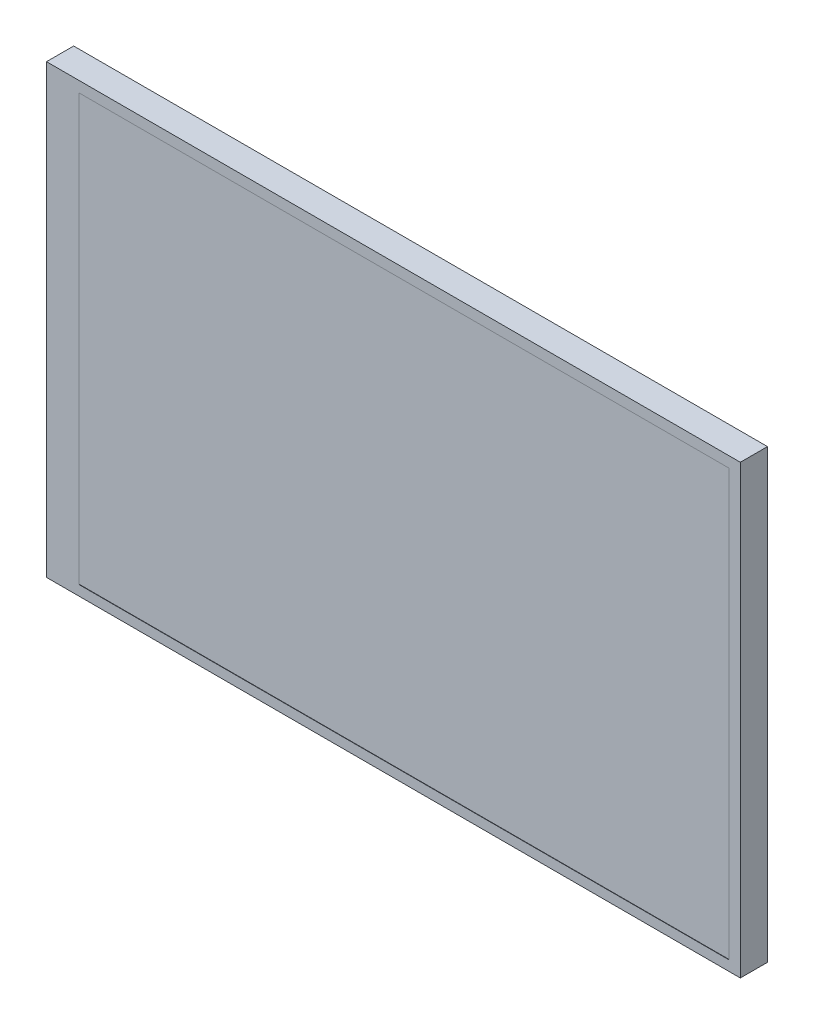
ISO-10303-21;
HEADER;
FILE_DESCRIPTION(('STEP AP214'),'2;1');
FILE_NAME('part.step','',(''),(''),'','','');
FILE_SCHEMA(('AUTOMOTIVE_DESIGN { 1 0 10303 214 1 1 1 1 }'));
ENDSEC;
DATA;
#1=APPLICATION_CONTEXT('core data for automotive mechanical design processes');
#2=APPLICATION_PROTOCOL_DEFINITION('international standard','automotive_design',2000,#1);
#3=PRODUCT_CONTEXT('',#1,'mechanical');
#4=PRODUCT('Part','Part','',(#3));
#5=PRODUCT_RELATED_PRODUCT_CATEGORY('part','',(#4));
#6=PRODUCT_DEFINITION_FORMATION('','',#4);
#7=PRODUCT_DEFINITION_CONTEXT('part definition',#1,'design');
#8=PRODUCT_DEFINITION('design','',#6,#7);
#9=PRODUCT_DEFINITION_SHAPE('','',#8);
#10=(LENGTH_UNIT() NAMED_UNIT(*) SI_UNIT(.MILLI.,.METRE.));
#11=(NAMED_UNIT(*) PLANE_ANGLE_UNIT() SI_UNIT($,.RADIAN.));
#12=(NAMED_UNIT(*) SI_UNIT($,.STERADIAN.) SOLID_ANGLE_UNIT());
#13=UNCERTAINTY_MEASURE_WITH_UNIT(LENGTH_MEASURE(1.E-05),#10,'distance_accuracy_value','');
#14=(GEOMETRIC_REPRESENTATION_CONTEXT(3) GLOBAL_UNCERTAINTY_ASSIGNED_CONTEXT((#13)) GLOBAL_UNIT_ASSIGNED_CONTEXT((#10,
#11,#12)) REPRESENTATION_CONTEXT('',''));
#15=CARTESIAN_POINT('',(0.,0.,0.));
#16=DIRECTION('',(0.,0.,1.));
#17=DIRECTION('',(1.,0.,0.));
#18=AXIS2_PLACEMENT_3D('',#15,#16,#17);
#19=CARTESIAN_POINT('',(0.,0.,3.7));
#20=DIRECTION('',(1.,0.,0.));
#21=DIRECTION('',(0.,1.,0.));
#22=AXIS2_PLACEMENT_3D('',#19,#20,#21);
#23=PLANE('',#22);
#24=DIRECTION('',(0.,-1.,0.));
#25=VECTOR('',#24,1.);
#26=CARTESIAN_POINT('',(0.,0.,0.));
#27=LINE('',#26,#25);
#28=CARTESIAN_POINT('',(0.,60.88,0.));
#29=VERTEX_POINT('',#28);
#30=CARTESIAN_POINT('',(0.,51.4389339288591,0.));
#31=VERTEX_POINT('',#30);
#32=EDGE_CURVE('E360',#29,#31,#27,.T.);
#33=ORIENTED_EDGE('',*,*,#32,.T.);
#34=DIRECTION('',(0.,0.,1.));
#35=VECTOR('',#34,1.);
#36=CARTESIAN_POINT('',(0.,51.4389339288591,-0.05));
#37=LINE('',#36,#35);
#38=CARTESIAN_POINT('',(0.,51.4389339288591,-0.05));
#39=VERTEX_POINT('',#38);
#40=EDGE_CURVE('E47',#39,#31,#37,.T.);
#41=ORIENTED_EDGE('',*,*,#40,.F.);
#42=DIRECTION('',(0.,1.,0.));
#43=VECTOR('',#42,1.);
#44=CARTESIAN_POINT('',(0.,0.,-0.05));
#45=LINE('',#44,#43);
#46=CARTESIAN_POINT('',(0.,9.44106607114088,-0.05));
#47=VERTEX_POINT('',#46);
#48=EDGE_CURVE('E227',#47,#39,#45,.T.);
#49=ORIENTED_EDGE('',*,*,#48,.F.);
#50=DIRECTION('',(0.,0.,1.));
#51=VECTOR('',#50,1.);
#52=CARTESIAN_POINT('',(0.,9.44106607114088,-0.05));
#53=LINE('',#52,#51);
#54=CARTESIAN_POINT('',(0.,9.44106607114088,0.));
#55=VERTEX_POINT('',#54);
#56=EDGE_CURVE('E266',#47,#55,#53,.T.);
#57=ORIENTED_EDGE('',*,*,#56,.T.);
#58=CARTESIAN_POINT('',(0.,0.,0.));
#59=VERTEX_POINT('',#58);
#60=EDGE_CURVE('E343',#55,#59,#27,.T.);
#61=ORIENTED_EDGE('',*,*,#60,.T.);
#62=DIRECTION('',(0.,0.,-1.));
#63=VECTOR('',#62,1.);
#64=CARTESIAN_POINT('',(0.,0.,3.7));
#65=LINE('',#64,#63);
#66=CARTESIAN_POINT('',(0.,0.,3.7));
#67=VERTEX_POINT('',#66);
#68=EDGE_CURVE('E11',#67,#59,#65,.T.);
#69=ORIENTED_EDGE('',*,*,#68,.F.);
#70=DIRECTION('',(0.,-1.,0.));
#71=VECTOR('',#70,1.);
#72=CARTESIAN_POINT('',(0.,0.,3.7));
#73=LINE('',#72,#71);
#74=CARTESIAN_POINT('',(0.,60.88,3.7));
#75=VERTEX_POINT('',#74);
#76=EDGE_CURVE('E349',#75,#67,#73,.T.);
#77=ORIENTED_EDGE('',*,*,#76,.F.);
#78=DIRECTION('',(0.,0.,-1.));
#79=VECTOR('',#78,1.);
#80=CARTESIAN_POINT('',(0.,60.88,3.7));
#81=LINE('',#80,#79);
#82=EDGE_CURVE('E359',#75,#29,#81,.T.);
#83=ORIENTED_EDGE('',*,*,#82,.T.);
#84=EDGE_LOOP('',(#33,#41,#49,#57,#61,#69,#77,#83));
#85=FACE_BOUND('',#84,.T.);
#86=ADVANCED_FACE('F33',(#85),#23,.F.);
#87=CARTESIAN_POINT('',(0.,0.,3.7));
#88=DIRECTION('',(0.,1.,0.));
#89=DIRECTION('',(0.,0.,1.));
#90=AXIS2_PLACEMENT_3D('',#87,#88,#89);
#91=PLANE('',#90);
#92=DIRECTION('',(1.,0.,0.));
#93=VECTOR('',#92,1.);
#94=CARTESIAN_POINT('',(0.,0.,0.));
#95=LINE('',#94,#93);
#96=CARTESIAN_POINT('',(94.57,0.,0.));
#97=VERTEX_POINT('',#96);
#98=EDGE_CURVE('E363',#59,#97,#95,.T.);
#99=ORIENTED_EDGE('',*,*,#98,.T.);
#100=DIRECTION('',(0.,0.,-1.));
#101=VECTOR('',#100,1.);
#102=CARTESIAN_POINT('',(94.57,0.,3.7));
#103=LINE('',#102,#101);
#104=CARTESIAN_POINT('',(94.57,0.,3.7));
#105=VERTEX_POINT('',#104);
#106=EDGE_CURVE('E40',#105,#97,#103,.T.);
#107=ORIENTED_EDGE('',*,*,#106,.F.);
#108=DIRECTION('',(1.,0.,0.));
#109=VECTOR('',#108,1.);
#110=CARTESIAN_POINT('',(0.,0.,3.7));
#111=LINE('',#110,#109);
#112=EDGE_CURVE('E352',#67,#105,#111,.T.);
#113=ORIENTED_EDGE('',*,*,#112,.F.);
#114=ORIENTED_EDGE('',*,*,#68,.T.);
#115=EDGE_LOOP('',(#99,#107,#113,#114));
#116=FACE_BOUND('',#115,.T.);
#117=ADVANCED_FACE('F396',(#116),#91,.F.);
#118=CARTESIAN_POINT('',(94.57,0.,3.7));
#119=DIRECTION('',(-1.,0.,0.));
#120=DIRECTION('',(0.,-1.,0.));
#121=AXIS2_PLACEMENT_3D('',#118,#119,#120);
#122=PLANE('',#121);
#123=DIRECTION('',(0.,1.,0.));
#124=VECTOR('',#123,1.);
#125=CARTESIAN_POINT('',(94.57,0.,0.));
#126=LINE('',#125,#124);
#127=CARTESIAN_POINT('',(94.57,60.88,0.));
#128=VERTEX_POINT('',#127);
#129=EDGE_CURVE('E365',#97,#128,#126,.T.);
#130=ORIENTED_EDGE('',*,*,#129,.T.);
#131=DIRECTION('',(0.,0.,-1.));
#132=VECTOR('',#131,1.);
#133=CARTESIAN_POINT('',(94.57,60.88,3.7));
#134=LINE('',#133,#132);
#135=CARTESIAN_POINT('',(94.57,60.88,3.7));
#136=VERTEX_POINT('',#135);
#137=EDGE_CURVE('E370',#136,#128,#134,.T.);
#138=ORIENTED_EDGE('',*,*,#137,.F.);
#139=DIRECTION('',(0.,1.,0.));
#140=VECTOR('',#139,1.);
#141=CARTESIAN_POINT('',(94.57,0.,3.7));
#142=LINE('',#141,#140);
#143=EDGE_CURVE('E355',#105,#136,#142,.T.);
#144=ORIENTED_EDGE('',*,*,#143,.F.);
#145=ORIENTED_EDGE('',*,*,#106,.T.);
#146=EDGE_LOOP('',(#130,#138,#144,#145));
#147=FACE_BOUND('',#146,.T.);
#148=ADVANCED_FACE('F377',(#147),#122,.F.);
#149=CARTESIAN_POINT('',(0.,60.88,3.7));
#150=DIRECTION('',(0.,-1.,0.));
#151=DIRECTION('',(0.,0.,-1.));
#152=AXIS2_PLACEMENT_3D('',#149,#150,#151);
#153=PLANE('',#152);
#154=DIRECTION('',(-1.,0.,0.));
#155=VECTOR('',#154,1.);
#156=CARTESIAN_POINT('',(0.,60.88,0.));
#157=LINE('',#156,#155);
#158=EDGE_CURVE('E353',#128,#29,#157,.T.);
#159=ORIENTED_EDGE('',*,*,#158,.T.);
#160=ORIENTED_EDGE('',*,*,#82,.F.);
#161=DIRECTION('',(-1.,0.,0.));
#162=VECTOR('',#161,1.);
#163=CARTESIAN_POINT('',(0.,60.88,3.7));
#164=LINE('',#163,#162);
#165=EDGE_CURVE('E357',#136,#75,#164,.T.);
#166=ORIENTED_EDGE('',*,*,#165,.F.);
#167=ORIENTED_EDGE('',*,*,#137,.T.);
#168=EDGE_LOOP('',(#159,#160,#166,#167));
#169=FACE_BOUND('',#168,.T.);
#170=ADVANCED_FACE('F389',(#169),#153,.F.);
#171=CARTESIAN_POINT('',(0.,0.,3.7));
#172=DIRECTION('',(0.,0.,-1.));
#173=DIRECTION('',(-1.,0.,0.));
#174=AXIS2_PLACEMENT_3D('',#171,#172,#173);
#175=PLANE('',#174);
#176=DIRECTION('',(-1.,0.,0.));
#177=VECTOR('',#176,1.);
#178=CARTESIAN_POINT('',(93.024602875844,59.4131648538576,3.7));
#179=LINE('',#178,#177);
#180=CARTESIAN_POINT('',(93.024602875844,59.4131648538576,3.7));
#181=VERTEX_POINT('',#180);
#182=CARTESIAN_POINT('',(4.39521661797805,59.4131648538576,3.7));
#183=VERTEX_POINT('',#182);
#184=EDGE_CURVE('E333',#181,#183,#179,.T.);
#185=ORIENTED_EDGE('',*,*,#184,.F.);
#186=DIRECTION('',(0.,1.,0.));
#187=VECTOR('',#186,1.);
#188=CARTESIAN_POINT('',(93.024602875844,59.4131648538576,3.7));
#189=LINE('',#188,#187);
#190=CARTESIAN_POINT('',(93.024602875844,1.37184116301504,3.7));
#191=VERTEX_POINT('',#190);
#192=EDGE_CURVE('E55',#191,#181,#189,.T.);
#193=ORIENTED_EDGE('',*,*,#192,.F.);
#194=DIRECTION('',(1.,0.,0.));
#195=VECTOR('',#194,1.);
#196=CARTESIAN_POINT('',(93.024602875844,1.37184116301504,3.7));
#197=LINE('',#196,#195);
#198=CARTESIAN_POINT('',(4.39521661797805,1.37184116301504,3.7));
#199=VERTEX_POINT('',#198);
#200=EDGE_CURVE('E322',#199,#191,#197,.T.);
#201=ORIENTED_EDGE('',*,*,#200,.F.);
#202=DIRECTION('',(0.,-1.,0.));
#203=VECTOR('',#202,1.);
#204=CARTESIAN_POINT('',(4.39521661797805,59.4131648538576,3.7));
#205=LINE('',#204,#203);
#206=EDGE_CURVE('E336',#183,#199,#205,.T.);
#207=ORIENTED_EDGE('',*,*,#206,.F.);
#208=EDGE_LOOP('',(#185,#193,#201,#207));
#209=FACE_BOUND('',#208,.T.);
#210=ORIENTED_EDGE('',*,*,#76,.T.);
#211=ORIENTED_EDGE('',*,*,#112,.T.);
#212=ORIENTED_EDGE('',*,*,#143,.T.);
#213=ORIENTED_EDGE('',*,*,#165,.T.);
#214=EDGE_LOOP('',(#210,#211,#212,#213));
#215=FACE_BOUND('',#214,.T.);
#216=ADVANCED_FACE('F395',(#209,#215),#175,.F.);
#217=CARTESIAN_POINT('',(0.,0.,0.));
#218=DIRECTION('',(0.,0.,-1.));
#219=DIRECTION('',(-1.,0.,0.));
#220=AXIS2_PLACEMENT_3D('',#217,#218,#219);
#221=PLANE('',#220);
#222=DIRECTION('',(-1.,0.,0.));
#223=VECTOR('',#222,1.);
#224=CARTESIAN_POINT('',(0.,9.44106607114088,0.));
#225=LINE('',#224,#223);
#226=CARTESIAN_POINT('',(9.09958970191095,9.44106607114088,0.));
#227=VERTEX_POINT('',#226);
#228=EDGE_CURVE('E230',#227,#55,#225,.T.);
#229=ORIENTED_EDGE('',*,*,#228,.F.);
#230=CARTESIAN_POINT('',(9.09958970191096,11.4410660711409,0.));
#231=DIRECTION('',(0.,0.,-1.));
#232=DIRECTION('',(-1.,0.,0.));
#233=AXIS2_PLACEMENT_3D('',#230,#231,#232);
#234=CIRCLE('',#233,2.);
#235=CARTESIAN_POINT('',(11.099589701911,11.4410660711409,0.));
#236=VERTEX_POINT('',#235);
#237=EDGE_CURVE('E289',#227,#236,#234,.F.);
#238=ORIENTED_EDGE('',*,*,#237,.T.);
#239=DIRECTION('',(0.,1.,0.));
#240=VECTOR('',#239,1.);
#241=CARTESIAN_POINT('',(11.099589701911,0.,0.));
#242=LINE('',#241,#240);
#243=CARTESIAN_POINT('',(11.099589701911,17.94,0.));
#244=VERTEX_POINT('',#243);
#245=EDGE_CURVE('E286',#236,#244,#242,.T.);
#246=ORIENTED_EDGE('',*,*,#245,.T.);
#247=CARTESIAN_POINT('',(13.099589701911,17.94,0.));
#248=DIRECTION('',(0.,0.,-1.));
#249=DIRECTION('',(-1.,0.,0.));
#250=AXIS2_PLACEMENT_3D('',#247,#248,#249);
#251=CIRCLE('',#250,2.);
#252=CARTESIAN_POINT('',(13.099589701911,19.94,0.));
#253=VERTEX_POINT('',#252);
#254=EDGE_CURVE('E283',#244,#253,#251,.T.);
#255=ORIENTED_EDGE('',*,*,#254,.T.);
#256=DIRECTION('',(1.,0.,0.));
#257=VECTOR('',#256,1.);
#258=CARTESIAN_POINT('',(0.,19.94,0.));
#259=LINE('',#258,#257);
#260=CARTESIAN_POINT('',(40.,19.94,0.));
#261=VERTEX_POINT('',#260);
#262=EDGE_CURVE('E280',#253,#261,#259,.T.);
#263=ORIENTED_EDGE('',*,*,#262,.T.);
#264=DIRECTION('',(0.,-1.,0.));
#265=VECTOR('',#264,1.);
#266=CARTESIAN_POINT('',(40.,0.,0.));
#267=LINE('',#266,#265);
#268=CARTESIAN_POINT('',(40.,40.94,0.));
#269=VERTEX_POINT('',#268);
#270=EDGE_CURVE('E277',#269,#261,#267,.T.);
#271=ORIENTED_EDGE('',*,*,#270,.F.);
#272=DIRECTION('',(1.,0.,0.));
#273=VECTOR('',#272,1.);
#274=CARTESIAN_POINT('',(0.,40.94,0.));
#275=LINE('',#274,#273);
#276=CARTESIAN_POINT('',(13.099589701911,40.94,0.));
#277=VERTEX_POINT('',#276);
#278=EDGE_CURVE('E275',#277,#269,#275,.T.);
#279=ORIENTED_EDGE('',*,*,#278,.F.);
#280=CARTESIAN_POINT('',(13.099589701911,42.94,0.));
#281=DIRECTION('',(0.,0.,-1.));
#282=DIRECTION('',(-1.,0.,0.));
#283=AXIS2_PLACEMENT_3D('',#280,#281,#282);
#284=CIRCLE('',#283,2.);
#285=CARTESIAN_POINT('',(11.099589701911,42.94,0.));
#286=VERTEX_POINT('',#285);
#287=EDGE_CURVE('E273',#286,#277,#284,.F.);
#288=ORIENTED_EDGE('',*,*,#287,.F.);
#289=DIRECTION('',(0.,1.,0.));
#290=VECTOR('',#289,1.);
#291=CARTESIAN_POINT('',(11.099589701911,0.,0.));
#292=LINE('',#291,#290);
#293=CARTESIAN_POINT('',(11.099589701911,49.4389339288591,0.));
#294=VERTEX_POINT('',#293);
#295=EDGE_CURVE('E270',#286,#294,#292,.T.);
#296=ORIENTED_EDGE('',*,*,#295,.T.);
#297=CARTESIAN_POINT('',(9.09958970191097,49.4389339288591,0.));
#298=DIRECTION('',(0.,0.,-1.));
#299=DIRECTION('',(-1.,0.,0.));
#300=AXIS2_PLACEMENT_3D('',#297,#298,#299);
#301=CIRCLE('',#300,2.);
#302=CARTESIAN_POINT('',(9.09958970191095,51.4389339288591,0.));
#303=VERTEX_POINT('',#302);
#304=EDGE_CURVE('E221',#294,#303,#301,.F.);
#305=ORIENTED_EDGE('',*,*,#304,.T.);
#306=DIRECTION('',(-1.,0.,0.));
#307=VECTOR('',#306,1.);
#308=CARTESIAN_POINT('',(0.,51.4389339288591,0.));
#309=LINE('',#308,#307);
#310=EDGE_CURVE('E219',#303,#31,#309,.T.);
#311=ORIENTED_EDGE('',*,*,#310,.T.);
#312=ORIENTED_EDGE('',*,*,#32,.F.);
#313=ORIENTED_EDGE('',*,*,#158,.F.);
#314=ORIENTED_EDGE('',*,*,#129,.F.);
#315=ORIENTED_EDGE('',*,*,#98,.F.);
#316=ORIENTED_EDGE('',*,*,#60,.F.);
#317=EDGE_LOOP('',(#229,#238,#246,#255,#263,#271,#279,#288,#296,#305,#311,#312,#313,#314,#315,#316));
#318=FACE_BOUND('',#317,.T.);
#319=ADVANCED_FACE('F384',(#318),#221,.T.);
#320=CARTESIAN_POINT('',(93.024602875844,59.4131648538576,3.65));
#321=DIRECTION('',(1.,0.,0.));
#322=DIRECTION('',(0.,0.,-1.));
#323=AXIS2_PLACEMENT_3D('',#320,#321,#322);
#324=PLANE('',#323);
#325=ORIENTED_EDGE('',*,*,#192,.T.);
#326=DIRECTION('',(0.,0.,1.));
#327=VECTOR('',#326,1.);
#328=CARTESIAN_POINT('',(93.024602875844,59.4131648538576,3.65));
#329=LINE('',#328,#327);
#330=CARTESIAN_POINT('',(93.024602875844,59.4131648538576,3.65));
#331=VERTEX_POINT('',#330);
#332=EDGE_CURVE('E331',#331,#181,#329,.T.);
#333=ORIENTED_EDGE('',*,*,#332,.F.);
#334=DIRECTION('',(0.,1.,0.));
#335=VECTOR('',#334,1.);
#336=CARTESIAN_POINT('',(93.024602875844,59.4131648538576,3.65));
#337=LINE('',#336,#335);
#338=CARTESIAN_POINT('',(93.024602875844,1.37184116301504,3.65));
#339=VERTEX_POINT('',#338);
#340=EDGE_CURVE('E318',#339,#331,#337,.T.);
#341=ORIENTED_EDGE('',*,*,#340,.F.);
#342=DIRECTION('',(0.,0.,1.));
#343=VECTOR('',#342,1.);
#344=CARTESIAN_POINT('',(93.024602875844,1.37184116301504,3.65));
#345=LINE('',#344,#343);
#346=EDGE_CURVE('E341',#339,#191,#345,.T.);
#347=ORIENTED_EDGE('',*,*,#346,.T.);
#348=EDGE_LOOP('',(#325,#333,#341,#347));
#349=FACE_BOUND('',#348,.T.);
#350=ADVANCED_FACE('F408',(#349),#324,.F.);
#351=CARTESIAN_POINT('',(93.024602875844,1.37184116301504,3.65));
#352=DIRECTION('',(0.,-1.,0.));
#353=DIRECTION('',(0.,0.,-1.));
#354=AXIS2_PLACEMENT_3D('',#351,#352,#353);
#355=PLANE('',#354);
#356=ORIENTED_EDGE('',*,*,#200,.T.);
#357=ORIENTED_EDGE('',*,*,#346,.F.);
#358=DIRECTION('',(1.,0.,0.));
#359=VECTOR('',#358,1.);
#360=CARTESIAN_POINT('',(93.024602875844,1.37184116301504,3.65));
#361=LINE('',#360,#359);
#362=CARTESIAN_POINT('',(4.39521661797805,1.37184116301504,3.65));
#363=VERTEX_POINT('',#362);
#364=EDGE_CURVE('E328',#363,#339,#361,.T.);
#365=ORIENTED_EDGE('',*,*,#364,.F.);
#366=DIRECTION('',(0.,0.,1.));
#367=VECTOR('',#366,1.);
#368=CARTESIAN_POINT('',(4.39521661797805,1.37184116301504,3.65));
#369=LINE('',#368,#367);
#370=EDGE_CURVE('E344',#363,#199,#369,.T.);
#371=ORIENTED_EDGE('',*,*,#370,.T.);
#372=EDGE_LOOP('',(#356,#357,#365,#371));
#373=FACE_BOUND('',#372,.T.);
#374=ADVANCED_FACE('F414',(#373),#355,.F.);
#375=CARTESIAN_POINT('',(4.39521661797805,59.4131648538576,3.65));
#376=DIRECTION('',(-1.,0.,0.));
#377=DIRECTION('',(0.,0.,1.));
#378=AXIS2_PLACEMENT_3D('',#375,#376,#377);
#379=PLANE('',#378);
#380=ORIENTED_EDGE('',*,*,#206,.T.);
#381=ORIENTED_EDGE('',*,*,#370,.F.);
#382=DIRECTION('',(0.,-1.,0.));
#383=VECTOR('',#382,1.);
#384=CARTESIAN_POINT('',(4.39521661797805,59.4131648538576,3.65));
#385=LINE('',#384,#383);
#386=CARTESIAN_POINT('',(4.39521661797805,59.4131648538576,3.65));
#387=VERTEX_POINT('',#386);
#388=EDGE_CURVE('E325',#387,#363,#385,.T.);
#389=ORIENTED_EDGE('',*,*,#388,.F.);
#390=DIRECTION('',(0.,0.,1.));
#391=VECTOR('',#390,1.);
#392=CARTESIAN_POINT('',(4.39521661797805,59.4131648538576,3.65));
#393=LINE('',#392,#391);
#394=EDGE_CURVE('E346',#387,#183,#393,.T.);
#395=ORIENTED_EDGE('',*,*,#394,.T.);
#396=EDGE_LOOP('',(#380,#381,#389,#395));
#397=FACE_BOUND('',#396,.T.);
#398=ADVANCED_FACE('F419',(#397),#379,.F.);
#399=CARTESIAN_POINT('',(93.024602875844,59.4131648538576,3.65));
#400=DIRECTION('',(0.,1.,0.));
#401=DIRECTION('',(0.,0.,1.));
#402=AXIS2_PLACEMENT_3D('',#399,#400,#401);
#403=PLANE('',#402);
#404=ORIENTED_EDGE('',*,*,#184,.T.);
#405=ORIENTED_EDGE('',*,*,#394,.F.);
#406=DIRECTION('',(-1.,0.,0.));
#407=VECTOR('',#406,1.);
#408=CARTESIAN_POINT('',(93.024602875844,59.4131648538576,3.65));
#409=LINE('',#408,#407);
#410=EDGE_CURVE('E321',#331,#387,#409,.T.);
#411=ORIENTED_EDGE('',*,*,#410,.F.);
#412=ORIENTED_EDGE('',*,*,#332,.T.);
#413=EDGE_LOOP('',(#404,#405,#411,#412));
#414=FACE_BOUND('',#413,.T.);
#415=ADVANCED_FACE('F415',(#414),#403,.F.);
#416=CARTESIAN_POINT('',(0.,0.,3.65));
#417=DIRECTION('',(0.,0.,-1.));
#418=DIRECTION('',(-1.,0.,0.));
#419=AXIS2_PLACEMENT_3D('',#416,#417,#418);
#420=PLANE('',#419);
#421=ORIENTED_EDGE('',*,*,#340,.T.);
#422=ORIENTED_EDGE('',*,*,#410,.T.);
#423=ORIENTED_EDGE('',*,*,#388,.T.);
#424=ORIENTED_EDGE('',*,*,#364,.T.);
#425=EDGE_LOOP('',(#421,#422,#423,#424));
#426=FACE_BOUND('',#425,.T.);
#427=ADVANCED_FACE('F418',(#426),#420,.F.);
#428=CARTESIAN_POINT('',(0.,51.4389339288591,-0.05));
#429=DIRECTION('',(0.,1.,0.));
#430=DIRECTION('',(0.,0.,1.));
#431=AXIS2_PLACEMENT_3D('',#428,#429,#430);
#432=PLANE('',#431);
#433=ORIENTED_EDGE('',*,*,#310,.F.);
#434=DIRECTION('',(0.,0.,1.));
#435=VECTOR('',#434,1.);
#436=CARTESIAN_POINT('',(9.09958970191095,51.4389339288591,-0.05));
#437=LINE('',#436,#435);
#438=CARTESIAN_POINT('',(9.09958970191095,51.4389339288591,-0.05));
#439=VERTEX_POINT('',#438);
#440=EDGE_CURVE('E315',#439,#303,#437,.T.);
#441=ORIENTED_EDGE('',*,*,#440,.F.);
#442=DIRECTION('',(-1.,0.,0.));
#443=VECTOR('',#442,1.);
#444=CARTESIAN_POINT('',(0.,51.4389339288591,-0.05));
#445=LINE('',#444,#443);
#446=EDGE_CURVE('E229',#439,#39,#445,.T.);
#447=ORIENTED_EDGE('',*,*,#446,.T.);
#448=ORIENTED_EDGE('',*,*,#40,.T.);
#449=EDGE_LOOP('',(#433,#441,#447,#448));
#450=FACE_BOUND('',#449,.T.);
#451=ADVANCED_FACE('F429',(#450),#432,.T.);
#452=CARTESIAN_POINT('',(9.09958970191097,49.4389339288591,-0.05));
#453=DIRECTION('',(0.,0.,1.));
#454=DIRECTION('',(1.,0.,0.));
#455=AXIS2_PLACEMENT_3D('',#452,#453,#454);
#456=CYLINDRICAL_SURFACE('',#455,2.);
#457=ORIENTED_EDGE('',*,*,#304,.F.);
#458=DIRECTION('',(0.,0.,1.));
#459=VECTOR('',#458,1.);
#460=CARTESIAN_POINT('',(11.099589701911,49.4389339288591,-0.05));
#461=LINE('',#460,#459);
#462=CARTESIAN_POINT('',(11.099589701911,49.4389339288591,-0.05));
#463=VERTEX_POINT('',#462);
#464=EDGE_CURVE('E313',#463,#294,#461,.T.);
#465=ORIENTED_EDGE('',*,*,#464,.F.);
#466=CARTESIAN_POINT('',(9.09958970191097,49.4389339288591,-0.05));
#467=DIRECTION('',(0.,0.,-1.));
#468=DIRECTION('',(-1.,0.,0.));
#469=AXIS2_PLACEMENT_3D('',#466,#467,#468);
#470=CIRCLE('',#469,2.);
#471=EDGE_CURVE('E232',#463,#439,#470,.F.);
#472=ORIENTED_EDGE('',*,*,#471,.T.);
#473=ORIENTED_EDGE('',*,*,#440,.T.);
#474=EDGE_LOOP('',(#457,#465,#472,#473));
#475=FACE_BOUND('',#474,.T.);
#476=ADVANCED_FACE('F433',(#475),#456,.T.);
#477=CARTESIAN_POINT('',(11.099589701911,0.,-0.05));
#478=DIRECTION('',(1.,0.,0.));
#479=DIRECTION('',(0.,0.,-1.));
#480=AXIS2_PLACEMENT_3D('',#477,#478,#479);
#481=PLANE('',#480);
#482=ORIENTED_EDGE('',*,*,#295,.F.);
#483=DIRECTION('',(0.,0.,1.));
#484=VECTOR('',#483,1.);
#485=CARTESIAN_POINT('',(11.099589701911,42.94,-0.05));
#486=LINE('',#485,#484);
#487=CARTESIAN_POINT('',(11.099589701911,42.94,-0.05));
#488=VERTEX_POINT('',#487);
#489=EDGE_CURVE('E311',#488,#286,#486,.T.);
#490=ORIENTED_EDGE('',*,*,#489,.F.);
#491=DIRECTION('',(0.,1.,0.));
#492=VECTOR('',#491,1.);
#493=CARTESIAN_POINT('',(11.099589701911,0.,-0.05));
#494=LINE('',#493,#492);
#495=EDGE_CURVE('E235',#488,#463,#494,.T.);
#496=ORIENTED_EDGE('',*,*,#495,.T.);
#497=ORIENTED_EDGE('',*,*,#464,.T.);
#498=EDGE_LOOP('',(#482,#490,#496,#497));
#499=FACE_BOUND('',#498,.T.);
#500=ADVANCED_FACE('F436',(#499),#481,.T.);
#501=CARTESIAN_POINT('',(13.099589701911,42.94,-0.05));
#502=DIRECTION('',(0.,0.,1.));
#503=DIRECTION('',(1.,0.,0.));
#504=AXIS2_PLACEMENT_3D('',#501,#502,#503);
#505=CYLINDRICAL_SURFACE('',#504,2.);
#506=ORIENTED_EDGE('',*,*,#287,.T.);
#507=DIRECTION('',(0.,0.,1.));
#508=VECTOR('',#507,1.);
#509=CARTESIAN_POINT('',(13.099589701911,40.94,-0.05));
#510=LINE('',#509,#508);
#511=CARTESIAN_POINT('',(13.099589701911,40.94,-0.05));
#512=VERTEX_POINT('',#511);
#513=EDGE_CURVE('E308',#512,#277,#510,.T.);
#514=ORIENTED_EDGE('',*,*,#513,.F.);
#515=CARTESIAN_POINT('',(13.099589701911,42.94,-0.05));
#516=DIRECTION('',(0.,0.,-1.));
#517=DIRECTION('',(-1.,0.,0.));
#518=AXIS2_PLACEMENT_3D('',#515,#516,#517);
#519=CIRCLE('',#518,2.);
#520=EDGE_CURVE('E238',#488,#512,#519,.F.);
#521=ORIENTED_EDGE('',*,*,#520,.F.);
#522=ORIENTED_EDGE('',*,*,#489,.T.);
#523=EDGE_LOOP('',(#506,#514,#521,#522));
#524=FACE_BOUND('',#523,.T.);
#525=ADVANCED_FACE('F440',(#524),#505,.F.);
#526=CARTESIAN_POINT('',(0.,40.94,-0.05));
#527=DIRECTION('',(0.,-1.,0.));
#528=DIRECTION('',(0.,0.,-1.));
#529=AXIS2_PLACEMENT_3D('',#526,#527,#528);
#530=PLANE('',#529);
#531=ORIENTED_EDGE('',*,*,#278,.T.);
#532=DIRECTION('',(0.,0.,1.));
#533=VECTOR('',#532,1.);
#534=CARTESIAN_POINT('',(40.,40.94,-0.05));
#535=LINE('',#534,#533);
#536=CARTESIAN_POINT('',(40.,40.94,-0.05));
#537=VERTEX_POINT('',#536);
#538=EDGE_CURVE('E305',#537,#269,#535,.T.);
#539=ORIENTED_EDGE('',*,*,#538,.F.);
#540=DIRECTION('',(1.,0.,0.));
#541=VECTOR('',#540,1.);
#542=CARTESIAN_POINT('',(0.,40.94,-0.05));
#543=LINE('',#542,#541);
#544=EDGE_CURVE('E240',#512,#537,#543,.T.);
#545=ORIENTED_EDGE('',*,*,#544,.F.);
#546=ORIENTED_EDGE('',*,*,#513,.T.);
#547=EDGE_LOOP('',(#531,#539,#545,#546));
#548=FACE_BOUND('',#547,.T.);
#549=ADVANCED_FACE('F444',(#548),#530,.F.);
#550=CARTESIAN_POINT('',(40.,0.,-0.05));
#551=DIRECTION('',(-1.,0.,0.));
#552=DIRECTION('',(0.,-1.,0.));
#553=AXIS2_PLACEMENT_3D('',#550,#551,#552);
#554=PLANE('',#553);
#555=ORIENTED_EDGE('',*,*,#270,.T.);
#556=DIRECTION('',(0.,0.,1.));
#557=VECTOR('',#556,1.);
#558=CARTESIAN_POINT('',(40.,19.94,-0.05));
#559=LINE('',#558,#557);
#560=CARTESIAN_POINT('',(40.,19.94,-0.05));
#561=VERTEX_POINT('',#560);
#562=EDGE_CURVE('E303',#561,#261,#559,.T.);
#563=ORIENTED_EDGE('',*,*,#562,.F.);
#564=DIRECTION('',(0.,-1.,0.));
#565=VECTOR('',#564,1.);
#566=CARTESIAN_POINT('',(40.,0.,-0.05));
#567=LINE('',#566,#565);
#568=EDGE_CURVE('E242',#537,#561,#567,.T.);
#569=ORIENTED_EDGE('',*,*,#568,.F.);
#570=ORIENTED_EDGE('',*,*,#538,.T.);
#571=EDGE_LOOP('',(#555,#563,#569,#570));
#572=FACE_BOUND('',#571,.T.);
#573=ADVANCED_FACE('F448',(#572),#554,.F.);
#574=CARTESIAN_POINT('',(0.,19.94,-0.05));
#575=DIRECTION('',(0.,-1.,0.));
#576=DIRECTION('',(1.,0.,0.));
#577=AXIS2_PLACEMENT_3D('',#574,#575,#576);
#578=PLANE('',#577);
#579=ORIENTED_EDGE('',*,*,#262,.F.);
#580=DIRECTION('',(0.,0.,1.));
#581=VECTOR('',#580,1.);
#582=CARTESIAN_POINT('',(13.099589701911,19.94,-0.05));
#583=LINE('',#582,#581);
#584=CARTESIAN_POINT('',(13.099589701911,19.94,-0.05));
#585=VERTEX_POINT('',#584);
#586=EDGE_CURVE('E301',#585,#253,#583,.T.);
#587=ORIENTED_EDGE('',*,*,#586,.F.);
#588=DIRECTION('',(1.,0.,0.));
#589=VECTOR('',#588,1.);
#590=CARTESIAN_POINT('',(0.,19.94,-0.05));
#591=LINE('',#590,#589);
#592=EDGE_CURVE('E244',#585,#561,#591,.T.);
#593=ORIENTED_EDGE('',*,*,#592,.T.);
#594=ORIENTED_EDGE('',*,*,#562,.T.);
#595=EDGE_LOOP('',(#579,#587,#593,#594));
#596=FACE_BOUND('',#595,.T.);
#597=ADVANCED_FACE('F452',(#596),#578,.T.);
#598=CARTESIAN_POINT('',(13.099589701911,17.94,-0.05));
#599=DIRECTION('',(0.,0.,1.));
#600=DIRECTION('',(1.,0.,0.));
#601=AXIS2_PLACEMENT_3D('',#598,#599,#600);
#602=CYLINDRICAL_SURFACE('',#601,2.);
#603=ORIENTED_EDGE('',*,*,#254,.F.);
#604=DIRECTION('',(0.,0.,1.));
#605=VECTOR('',#604,1.);
#606=CARTESIAN_POINT('',(11.099589701911,17.94,-0.05));
#607=LINE('',#606,#605);
#608=CARTESIAN_POINT('',(11.099589701911,17.94,-0.05));
#609=VERTEX_POINT('',#608);
#610=EDGE_CURVE('E299',#609,#244,#607,.T.);
#611=ORIENTED_EDGE('',*,*,#610,.F.);
#612=CARTESIAN_POINT('',(13.099589701911,17.94,-0.05));
#613=DIRECTION('',(0.,0.,-1.));
#614=DIRECTION('',(-1.,0.,0.));
#615=AXIS2_PLACEMENT_3D('',#612,#613,#614);
#616=CIRCLE('',#615,2.);
#617=EDGE_CURVE('E247',#609,#585,#616,.T.);
#618=ORIENTED_EDGE('',*,*,#617,.T.);
#619=ORIENTED_EDGE('',*,*,#586,.T.);
#620=EDGE_LOOP('',(#603,#611,#618,#619));
#621=FACE_BOUND('',#620,.T.);
#622=ADVANCED_FACE('F456',(#621),#602,.F.);
#623=CARTESIAN_POINT('',(11.099589701911,0.,-0.05));
#624=DIRECTION('',(1.,0.,0.));
#625=DIRECTION('',(0.,1.,0.));
#626=AXIS2_PLACEMENT_3D('',#623,#624,#625);
#627=PLANE('',#626);
#628=ORIENTED_EDGE('',*,*,#245,.F.);
#629=DIRECTION('',(0.,0.,1.));
#630=VECTOR('',#629,1.);
#631=CARTESIAN_POINT('',(11.099589701911,11.4410660711409,-0.05));
#632=LINE('',#631,#630);
#633=CARTESIAN_POINT('',(11.099589701911,11.4410660711409,-0.05));
#634=VERTEX_POINT('',#633);
#635=EDGE_CURVE('E297',#634,#236,#632,.T.);
#636=ORIENTED_EDGE('',*,*,#635,.F.);
#637=DIRECTION('',(0.,1.,0.));
#638=VECTOR('',#637,1.);
#639=CARTESIAN_POINT('',(11.099589701911,0.,-0.05));
#640=LINE('',#639,#638);
#641=EDGE_CURVE('E250',#634,#609,#640,.T.);
#642=ORIENTED_EDGE('',*,*,#641,.T.);
#643=ORIENTED_EDGE('',*,*,#610,.T.);
#644=EDGE_LOOP('',(#628,#636,#642,#643));
#645=FACE_BOUND('',#644,.T.);
#646=ADVANCED_FACE('F460',(#645),#627,.T.);
#647=CARTESIAN_POINT('',(9.09958970191096,11.4410660711409,-0.05));
#648=DIRECTION('',(0.,0.,1.));
#649=DIRECTION('',(1.,0.,0.));
#650=AXIS2_PLACEMENT_3D('',#647,#648,#649);
#651=CYLINDRICAL_SURFACE('',#650,2.);
#652=ORIENTED_EDGE('',*,*,#237,.F.);
#653=DIRECTION('',(0.,0.,1.));
#654=VECTOR('',#653,1.);
#655=CARTESIAN_POINT('',(9.09958970191095,9.44106607114088,-0.05));
#656=LINE('',#655,#654);
#657=CARTESIAN_POINT('',(9.09958970191095,9.44106607114088,-0.05));
#658=VERTEX_POINT('',#657);
#659=EDGE_CURVE('E295',#658,#227,#656,.T.);
#660=ORIENTED_EDGE('',*,*,#659,.F.);
#661=CARTESIAN_POINT('',(9.09958970191096,11.4410660711409,-0.05));
#662=DIRECTION('',(0.,0.,-1.));
#663=DIRECTION('',(-1.,0.,0.));
#664=AXIS2_PLACEMENT_3D('',#661,#662,#663);
#665=CIRCLE('',#664,2.);
#666=EDGE_CURVE('E253',#658,#634,#665,.F.);
#667=ORIENTED_EDGE('',*,*,#666,.T.);
#668=ORIENTED_EDGE('',*,*,#635,.T.);
#669=EDGE_LOOP('',(#652,#660,#667,#668));
#670=FACE_BOUND('',#669,.T.);
#671=ADVANCED_FACE('F464',(#670),#651,.T.);
#672=CARTESIAN_POINT('',(0.,9.44106607114088,-0.05));
#673=DIRECTION('',(0.,1.,0.));
#674=DIRECTION('',(0.,0.,1.));
#675=AXIS2_PLACEMENT_3D('',#672,#673,#674);
#676=PLANE('',#675);
#677=ORIENTED_EDGE('',*,*,#228,.T.);
#678=ORIENTED_EDGE('',*,*,#56,.F.);
#679=DIRECTION('',(-1.,0.,0.));
#680=VECTOR('',#679,1.);
#681=CARTESIAN_POINT('',(0.,9.44106607114088,-0.05));
#682=LINE('',#681,#680);
#683=EDGE_CURVE('E256',#658,#47,#682,.T.);
#684=ORIENTED_EDGE('',*,*,#683,.F.);
#685=ORIENTED_EDGE('',*,*,#659,.T.);
#686=EDGE_LOOP('',(#677,#678,#684,#685));
#687=FACE_BOUND('',#686,.T.);
#688=ADVANCED_FACE('F468',(#687),#676,.F.);
#689=CARTESIAN_POINT('',(0.,0.,-0.05));
#690=DIRECTION('',(0.,0.,-1.));
#691=DIRECTION('',(-1.,0.,0.));
#692=AXIS2_PLACEMENT_3D('',#689,#690,#691);
#693=PLANE('',#692);
#694=ORIENTED_EDGE('',*,*,#48,.T.);
#695=ORIENTED_EDGE('',*,*,#446,.F.);
#696=ORIENTED_EDGE('',*,*,#471,.F.);
#697=ORIENTED_EDGE('',*,*,#495,.F.);
#698=ORIENTED_EDGE('',*,*,#520,.T.);
#699=ORIENTED_EDGE('',*,*,#544,.T.);
#700=ORIENTED_EDGE('',*,*,#568,.T.);
#701=ORIENTED_EDGE('',*,*,#592,.F.);
#702=ORIENTED_EDGE('',*,*,#617,.F.);
#703=ORIENTED_EDGE('',*,*,#641,.F.);
#704=ORIENTED_EDGE('',*,*,#666,.F.);
#705=ORIENTED_EDGE('',*,*,#683,.T.);
#706=EDGE_LOOP('',(#694,#695,#696,#697,#698,#699,#700,#701,#702,#703,#704,#705));
#707=FACE_BOUND('',#706,.T.);
#708=DIRECTION('',(0.,-1.,0.));
#709=VECTOR('',#708,1.);
#710=CARTESIAN_POINT('',(39.8851142519205,0.,-0.05));
#711=LINE('',#710,#709);
#712=CARTESIAN_POINT('',(39.8851142519205,40.1879238776347,-0.05));
#713=VERTEX_POINT('',#712);
#714=CARTESIAN_POINT('',(39.8851142519205,20.6920761223653,-0.05));
#715=VERTEX_POINT('',#714);
#716=EDGE_CURVE('E258',#713,#715,#711,.T.);
#717=ORIENTED_EDGE('',*,*,#716,.F.);
#718=DIRECTION('',(1.,0.,0.));
#719=VECTOR('',#718,1.);
#720=CARTESIAN_POINT('',(0.,40.1879238776347,-0.05));
#721=LINE('',#720,#719);
#722=CARTESIAN_POINT('',(35.9976886748942,40.1879238776347,-0.05));
#723=VERTEX_POINT('',#722);
#724=EDGE_CURVE('E261',#723,#713,#721,.T.);
#725=ORIENTED_EDGE('',*,*,#724,.F.);
#726=DIRECTION('',(0.,-1.,0.));
#727=VECTOR('',#726,1.);
#728=CARTESIAN_POINT('',(35.9976886748942,0.,-0.05));
#729=LINE('',#728,#727);
#730=CARTESIAN_POINT('',(35.9976886748942,20.6920761223653,-0.05));
#731=VERTEX_POINT('',#730);
#732=EDGE_CURVE('E218',#723,#731,#729,.T.);
#733=ORIENTED_EDGE('',*,*,#732,.T.);
#734=DIRECTION('',(1.,0.,0.));
#735=VECTOR('',#734,1.);
#736=CARTESIAN_POINT('',(0.,20.6920761223653,-0.05));
#737=LINE('',#736,#735);
#738=EDGE_CURVE('E264',#731,#715,#737,.T.);
#739=ORIENTED_EDGE('',*,*,#738,.T.);
#740=EDGE_LOOP('',(#717,#725,#733,#739));
#741=FACE_BOUND('',#740,.T.);
#742=ADVANCED_FACE('F472',(#707,#741),#693,.T.);
#743=CARTESIAN_POINT('',(35.9976886748942,20.6920761223653,-0.1));
#744=DIRECTION('',(1.,0.,0.));
#745=DIRECTION('',(0.,0.,-1.));
#746=AXIS2_PLACEMENT_3D('',#743,#744,#745);
#747=PLANE('',#746);
#748=ORIENTED_EDGE('',*,*,#732,.F.);
#749=DIRECTION('',(0.,0.,1.));
#750=VECTOR('',#749,1.);
#751=CARTESIAN_POINT('',(35.9976886748942,40.1879238776347,-0.1));
#752=LINE('',#751,#750);
#753=CARTESIAN_POINT('',(35.9976886748942,40.1879238776347,-0.1));
#754=VERTEX_POINT('',#753);
#755=EDGE_CURVE('E199',#754,#723,#752,.T.);
#756=ORIENTED_EDGE('',*,*,#755,.F.);
#757=DIRECTION('',(0.,1.,0.));
#758=VECTOR('',#757,1.);
#759=CARTESIAN_POINT('',(35.9976886748942,20.6920761223653,-0.1));
#760=LINE('',#759,#758);
#761=CARTESIAN_POINT('',(35.9976886748942,20.6920761223653,-0.1));
#762=VERTEX_POINT('',#761);
#763=EDGE_CURVE('E206',#762,#754,#760,.T.);
#764=ORIENTED_EDGE('',*,*,#763,.F.);
#765=DIRECTION('',(0.,0.,1.));
#766=VECTOR('',#765,1.);
#767=CARTESIAN_POINT('',(35.9976886748942,20.6920761223653,-0.1));
#768=LINE('',#767,#766);
#769=EDGE_CURVE('E665',#762,#731,#768,.T.);
#770=ORIENTED_EDGE('',*,*,#769,.T.);
#771=EDGE_LOOP('',(#748,#756,#764,#770));
#772=FACE_BOUND('',#771,.T.);
#773=ADVANCED_FACE('F216',(#772),#747,.F.);
#774=CARTESIAN_POINT('',(35.9976886748942,40.1879238776347,-0.1));
#775=DIRECTION('',(0.,-1.,0.));
#776=DIRECTION('',(0.,0.,-1.));
#777=AXIS2_PLACEMENT_3D('',#774,#775,#776);
#778=PLANE('',#777);
#779=ORIENTED_EDGE('',*,*,#724,.T.);
#780=DIRECTION('',(0.,0.,1.));
#781=VECTOR('',#780,1.);
#782=CARTESIAN_POINT('',(39.8851142519205,40.1879238776347,-0.1));
#783=LINE('',#782,#781);
#784=CARTESIAN_POINT('',(39.8851142519205,40.1879238776347,-0.1));
#785=VERTEX_POINT('',#784);
#786=EDGE_CURVE('E202',#785,#713,#783,.T.);
#787=ORIENTED_EDGE('',*,*,#786,.F.);
#788=DIRECTION('',(1.,0.,0.));
#789=VECTOR('',#788,1.);
#790=CARTESIAN_POINT('',(35.9976886748942,40.1879238776347,-0.1));
#791=LINE('',#790,#789);
#792=EDGE_CURVE('E195',#754,#785,#791,.T.);
#793=ORIENTED_EDGE('',*,*,#792,.F.);
#794=ORIENTED_EDGE('',*,*,#755,.T.);
#795=EDGE_LOOP('',(#779,#787,#793,#794));
#796=FACE_BOUND('',#795,.T.);
#797=ADVANCED_FACE('F197',(#796),#778,.F.);
#798=CARTESIAN_POINT('',(39.8851142519205,20.6920761223653,-0.1));
#799=DIRECTION('',(-1.,0.,0.));
#800=DIRECTION('',(0.,0.,1.));
#801=AXIS2_PLACEMENT_3D('',#798,#799,#800);
#802=PLANE('',#801);
#803=ORIENTED_EDGE('',*,*,#716,.T.);
#804=DIRECTION('',(0.,0.,1.));
#805=VECTOR('',#804,1.);
#806=CARTESIAN_POINT('',(39.8851142519205,20.6920761223653,-0.1));
#807=LINE('',#806,#805);
#808=CARTESIAN_POINT('',(39.8851142519205,20.6920761223653,-0.1));
#809=VERTEX_POINT('',#808);
#810=EDGE_CURVE('E223',#809,#715,#807,.T.);
#811=ORIENTED_EDGE('',*,*,#810,.F.);
#812=DIRECTION('',(0.,-1.,0.));
#813=VECTOR('',#812,1.);
#814=CARTESIAN_POINT('',(39.8851142519205,20.6920761223653,-0.1));
#815=LINE('',#814,#813);
#816=EDGE_CURVE('E205',#785,#809,#815,.T.);
#817=ORIENTED_EDGE('',*,*,#816,.F.);
#818=ORIENTED_EDGE('',*,*,#786,.T.);
#819=EDGE_LOOP('',(#803,#811,#817,#818));
#820=FACE_BOUND('',#819,.T.);
#821=ADVANCED_FACE('F481',(#820),#802,.F.);
#822=CARTESIAN_POINT('',(35.9976886748942,20.6920761223653,-0.1));
#823=DIRECTION('',(0.,1.,0.));
#824=DIRECTION('',(0.,0.,1.));
#825=AXIS2_PLACEMENT_3D('',#822,#823,#824);
#826=PLANE('',#825);
#827=ORIENTED_EDGE('',*,*,#738,.F.);
#828=ORIENTED_EDGE('',*,*,#769,.F.);
#829=DIRECTION('',(-1.,0.,0.));
#830=VECTOR('',#829,1.);
#831=CARTESIAN_POINT('',(35.9976886748942,20.6920761223653,-0.1));
#832=LINE('',#831,#830);
#833=EDGE_CURVE('E211',#809,#762,#832,.T.);
#834=ORIENTED_EDGE('',*,*,#833,.F.);
#835=ORIENTED_EDGE('',*,*,#810,.T.);
#836=EDGE_LOOP('',(#827,#828,#834,#835));
#837=FACE_BOUND('',#836,.T.);
#838=ADVANCED_FACE('F484',(#837),#826,.F.);
#839=CARTESIAN_POINT('',(0.,0.,-0.1));
#840=DIRECTION('',(0.,0.,-1.));
#841=DIRECTION('',(-1.,0.,0.));
#842=AXIS2_PLACEMENT_3D('',#839,#840,#841);
#843=PLANE('',#842);
#844=ORIENTED_EDGE('',*,*,#763,.T.);
#845=ORIENTED_EDGE('',*,*,#792,.T.);
#846=ORIENTED_EDGE('',*,*,#816,.T.);
#847=ORIENTED_EDGE('',*,*,#833,.T.);
#848=EDGE_LOOP('',(#844,#845,#846,#847));
#849=FACE_BOUND('',#848,.T.);
#850=ADVANCED_FACE('F209',(#849),#843,.T.);
#851=CLOSED_SHELL('',(#86,#117,#148,#170,#216,#319,#350,#374,#398,#415,#427,#451,#476,#500,#525,
#549,#573,#597,#622,#646,#671,#688,#742,#773,#797,#821,#838,#850));
#852=MANIFOLD_SOLID_BREP('B2',#851);
#853=ADVANCED_BREP_SHAPE_REPRESENTATION('',(#18,#852),#14);
#854=SHAPE_DEFINITION_REPRESENTATION(#9,#853);
ENDSEC;
END-ISO-10303-21;
